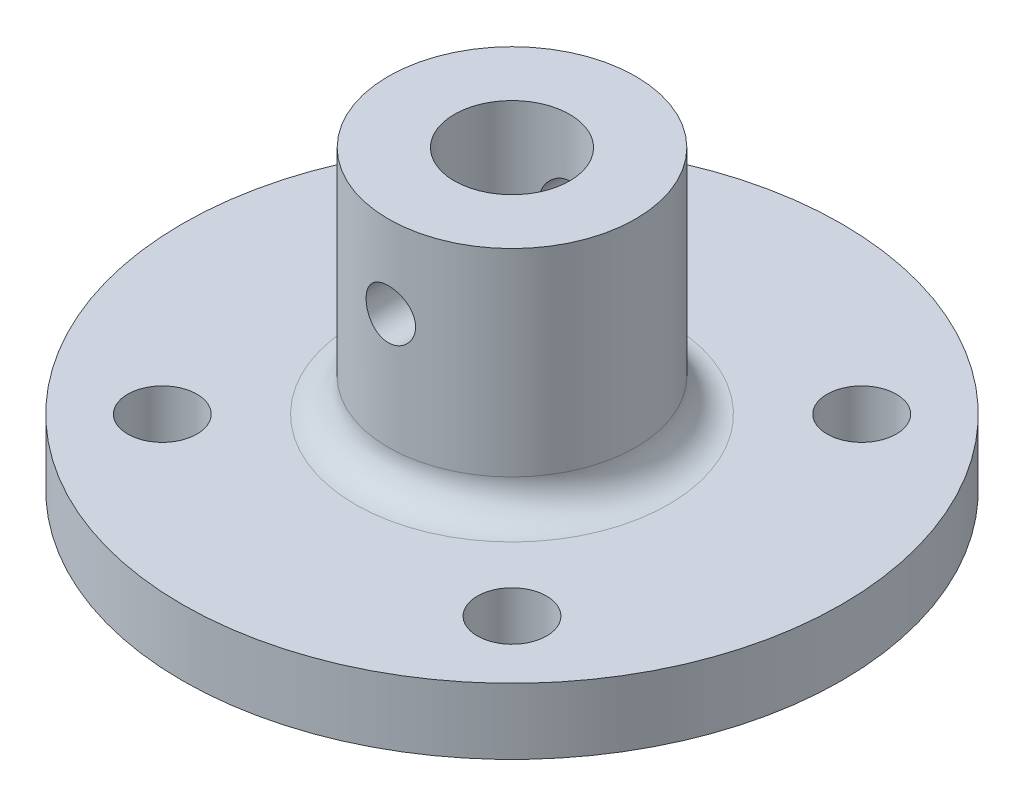
ISO-10303-21;
HEADER;
FILE_DESCRIPTION(('STEP AP214'),'2;1');
FILE_NAME('part.step','',(''),(''),'','','');
FILE_SCHEMA(('AUTOMOTIVE_DESIGN { 1 0 10303 214 1 1 1 1 }'));
ENDSEC;
DATA;
#1=APPLICATION_CONTEXT('core data for automotive mechanical design processes');
#2=APPLICATION_PROTOCOL_DEFINITION('international standard','automotive_design',2000,#1);
#3=PRODUCT_CONTEXT('',#1,'mechanical');
#4=PRODUCT('Part','Part','',(#3));
#5=PRODUCT_RELATED_PRODUCT_CATEGORY('part','',(#4));
#6=PRODUCT_DEFINITION_FORMATION('','',#4);
#7=PRODUCT_DEFINITION_CONTEXT('part definition',#1,'design');
#8=PRODUCT_DEFINITION('design','',#6,#7);
#9=PRODUCT_DEFINITION_SHAPE('','',#8);
#10=(LENGTH_UNIT() NAMED_UNIT(*) SI_UNIT(.MILLI.,.METRE.));
#11=(NAMED_UNIT(*) PLANE_ANGLE_UNIT() SI_UNIT($,.RADIAN.));
#12=(NAMED_UNIT(*) SI_UNIT($,.STERADIAN.) SOLID_ANGLE_UNIT());
#13=UNCERTAINTY_MEASURE_WITH_UNIT(LENGTH_MEASURE(1.E-05),#10,'distance_accuracy_value','');
#14=(GEOMETRIC_REPRESENTATION_CONTEXT(3) GLOBAL_UNCERTAINTY_ASSIGNED_CONTEXT((#13)) GLOBAL_UNIT_ASSIGNED_CONTEXT((#10,
#11,#12)) REPRESENTATION_CONTEXT('',''));
#15=CARTESIAN_POINT('',(0.,0.,0.));
#16=DIRECTION('',(0.,0.,1.));
#17=DIRECTION('',(1.,0.,0.));
#18=AXIS2_PLACEMENT_3D('',#15,#16,#17);
#19=CARTESIAN_POINT('',(0.,4.,0.));
#20=DIRECTION('',(0.,-1.,0.));
#21=DIRECTION('',(0.,0.,-1.));
#22=AXIS2_PLACEMENT_3D('',#19,#20,#21);
#23=CYLINDRICAL_SURFACE('',#22,20.);
#24=CARTESIAN_POINT('',(0.,4.,0.));
#25=DIRECTION('',(0.,1.,0.));
#26=DIRECTION('',(0.,0.,1.));
#27=AXIS2_PLACEMENT_3D('',#24,#25,#26);
#28=CIRCLE('',#27,20.);
#29=CARTESIAN_POINT('',(0.,4.,20.));
#30=VERTEX_POINT('',#29);
#31=EDGE_CURVE('E50',#30,#30,#28,.T.);
#32=ORIENTED_EDGE('',*,*,#31,.F.);
#33=EDGE_LOOP('',(#32));
#34=FACE_BOUND('',#33,.T.);
#35=CARTESIAN_POINT('',(0.,0.,0.));
#36=DIRECTION('',(0.,1.,0.));
#37=DIRECTION('',(0.,0.,1.));
#38=AXIS2_PLACEMENT_3D('',#35,#36,#37);
#39=CIRCLE('',#38,20.);
#40=CARTESIAN_POINT('',(0.,0.,20.));
#41=VERTEX_POINT('',#40);
#42=EDGE_CURVE('E55',#41,#41,#39,.T.);
#43=ORIENTED_EDGE('',*,*,#42,.T.);
#44=EDGE_LOOP('',(#43));
#45=FACE_BOUND('',#44,.T.);
#46=ADVANCED_FACE('F37',(#34,#45),#23,.T.);
#47=CARTESIAN_POINT('',(0.,4.,0.));
#48=DIRECTION('',(0.,1.,0.));
#49=DIRECTION('',(0.,0.,1.));
#50=AXIS2_PLACEMENT_3D('',#47,#48,#49);
#51=PLANE('',#50);
#52=CARTESIAN_POINT('',(-10.6066017177982,4.,10.6066017177982));
#53=DIRECTION('',(0.,1.,0.));
#54=DIRECTION('',(0.,0.,1.));
#55=AXIS2_PLACEMENT_3D('',#52,#53,#54);
#56=CIRCLE('',#55,2.1);
#57=CARTESIAN_POINT('',(-10.6066017177982,4.,12.7066017177982));
#58=VERTEX_POINT('',#57);
#59=EDGE_CURVE('E257',#58,#58,#56,.T.);
#60=ORIENTED_EDGE('',*,*,#59,.F.);
#61=EDGE_LOOP('',(#60));
#62=FACE_BOUND('',#61,.T.);
#63=CARTESIAN_POINT('',(-10.6066017177982,4.,-10.6066017177982));
#64=DIRECTION('',(0.,1.,0.));
#65=DIRECTION('',(0.,0.,1.));
#66=AXIS2_PLACEMENT_3D('',#63,#64,#65);
#67=CIRCLE('',#66,2.1);
#68=CARTESIAN_POINT('',(-10.6066017177982,4.,-8.50660171779819));
#69=VERTEX_POINT('',#68);
#70=EDGE_CURVE('E261',#69,#69,#67,.T.);
#71=ORIENTED_EDGE('',*,*,#70,.F.);
#72=EDGE_LOOP('',(#71));
#73=FACE_BOUND('',#72,.T.);
#74=CARTESIAN_POINT('',(10.6066017177982,4.,-10.6066017177982));
#75=DIRECTION('',(0.,1.,0.));
#76=DIRECTION('',(0.,0.,1.));
#77=AXIS2_PLACEMENT_3D('',#74,#75,#76);
#78=CIRCLE('',#77,2.1);
#79=CARTESIAN_POINT('',(10.6066017177982,4.,-8.50660171779819));
#80=VERTEX_POINT('',#79);
#81=EDGE_CURVE('E278',#80,#80,#78,.T.);
#82=ORIENTED_EDGE('',*,*,#81,.F.);
#83=EDGE_LOOP('',(#82));
#84=FACE_BOUND('',#83,.T.);
#85=CARTESIAN_POINT('',(10.6066017177982,4.,10.6066017177982));
#86=DIRECTION('',(0.,1.,0.));
#87=DIRECTION('',(0.,0.,1.));
#88=AXIS2_PLACEMENT_3D('',#85,#86,#87);
#89=CIRCLE('',#88,2.1);
#90=CARTESIAN_POINT('',(10.6066017177982,4.,12.7066017177982));
#91=VERTEX_POINT('',#90);
#92=EDGE_CURVE('E99',#91,#91,#89,.T.);
#93=ORIENTED_EDGE('',*,*,#92,.F.);
#94=EDGE_LOOP('',(#93));
#95=FACE_BOUND('',#94,.T.);
#96=CARTESIAN_POINT('',(0.,4.,0.));
#97=DIRECTION('',(0.,1.,0.));
#98=DIRECTION('',(0.,0.,1.));
#99=AXIS2_PLACEMENT_3D('',#96,#97,#98);
#100=CIRCLE('',#99,9.5);
#101=CARTESIAN_POINT('',(0.,4.,9.5));
#102=VERTEX_POINT('',#101);
#103=EDGE_CURVE('E10',#102,#102,#100,.F.);
#104=ORIENTED_EDGE('',*,*,#103,.T.);
#105=EDGE_LOOP('',(#104));
#106=FACE_BOUND('',#105,.T.);
#107=ORIENTED_EDGE('',*,*,#31,.T.);
#108=EDGE_LOOP('',(#107));
#109=FACE_BOUND('',#108,.T.);
#110=ADVANCED_FACE('F111',(#62,#73,#84,#95,#106,#109),#51,.T.);
#111=CARTESIAN_POINT('',(0.,0.,0.));
#112=DIRECTION('',(0.,1.,0.));
#113=DIRECTION('',(0.,0.,1.));
#114=AXIS2_PLACEMENT_3D('',#111,#112,#113);
#115=PLANE('',#114);
#116=CARTESIAN_POINT('',(-10.6066017177982,0.,10.6066017177982));
#117=DIRECTION('',(0.,1.,0.));
#118=DIRECTION('',(0.,0.,1.));
#119=AXIS2_PLACEMENT_3D('',#116,#117,#118);
#120=CIRCLE('',#119,2.1);
#121=CARTESIAN_POINT('',(-10.6066017177982,0.,12.7066017177982));
#122=VERTEX_POINT('',#121);
#123=EDGE_CURVE('E254',#122,#122,#120,.T.);
#124=ORIENTED_EDGE('',*,*,#123,.T.);
#125=EDGE_LOOP('',(#124));
#126=FACE_BOUND('',#125,.T.);
#127=CARTESIAN_POINT('',(-10.6066017177982,0.,-10.6066017177982));
#128=DIRECTION('',(0.,1.,0.));
#129=DIRECTION('',(0.,0.,1.));
#130=AXIS2_PLACEMENT_3D('',#127,#128,#129);
#131=CIRCLE('',#130,2.1);
#132=CARTESIAN_POINT('',(-10.6066017177982,0.,-8.50660171779819));
#133=VERTEX_POINT('',#132);
#134=EDGE_CURVE('E284',#133,#133,#131,.T.);
#135=ORIENTED_EDGE('',*,*,#134,.T.);
#136=EDGE_LOOP('',(#135));
#137=FACE_BOUND('',#136,.T.);
#138=CARTESIAN_POINT('',(10.6066017177982,0.,-10.6066017177982));
#139=DIRECTION('',(0.,1.,0.));
#140=DIRECTION('',(0.,0.,1.));
#141=AXIS2_PLACEMENT_3D('',#138,#139,#140);
#142=CIRCLE('',#141,2.1);
#143=CARTESIAN_POINT('',(10.6066017177982,0.,-8.50660171779819));
#144=VERTEX_POINT('',#143);
#145=EDGE_CURVE('E273',#144,#144,#142,.T.);
#146=ORIENTED_EDGE('',*,*,#145,.T.);
#147=EDGE_LOOP('',(#146));
#148=FACE_BOUND('',#147,.T.);
#149=CARTESIAN_POINT('',(10.6066017177982,0.,10.6066017177982));
#150=DIRECTION('',(0.,1.,0.));
#151=DIRECTION('',(0.,0.,1.));
#152=AXIS2_PLACEMENT_3D('',#149,#150,#151);
#153=CIRCLE('',#152,2.1);
#154=CARTESIAN_POINT('',(10.6066017177982,0.,12.7066017177982));
#155=VERTEX_POINT('',#154);
#156=EDGE_CURVE('E264',#155,#155,#153,.T.);
#157=ORIENTED_EDGE('',*,*,#156,.T.);
#158=EDGE_LOOP('',(#157));
#159=FACE_BOUND('',#158,.T.);
#160=ORIENTED_EDGE('',*,*,#42,.F.);
#161=EDGE_LOOP('',(#160));
#162=FACE_BOUND('',#161,.T.);
#163=ADVANCED_FACE('F110',(#126,#137,#148,#159,#162),#115,.F.);
#164=CARTESIAN_POINT('',(0.,18.,0.));
#165=DIRECTION('',(0.,-1.,0.));
#166=DIRECTION('',(0.,0.,-1.));
#167=AXIS2_PLACEMENT_3D('',#164,#165,#166);
#168=CYLINDRICAL_SURFACE('',#167,7.5);
#169=CARTESIAN_POINT('',(0.,6.,0.));
#170=DIRECTION('',(0.,1.,0.));
#171=DIRECTION('',(0.,0.,1.));
#172=AXIS2_PLACEMENT_3D('',#169,#170,#171);
#173=CIRCLE('',#172,7.5);
#174=CARTESIAN_POINT('',(0.,6.,7.5));
#175=VERTEX_POINT('',#174);
#176=EDGE_CURVE('E45',#175,#175,#173,.T.);
#177=ORIENTED_EDGE('',*,*,#176,.T.);
#178=EDGE_LOOP('',(#177));
#179=FACE_BOUND('',#178,.T.);
#180=CARTESIAN_POINT('',(0.,14.5,-7.5));
#181=CARTESIAN_POINT('',(-0.0833653601889497,14.4999969332525,-7.49999846371307));
#182=CARTESIAN_POINT('',(-0.166769490302283,14.4930267355485,-7.49859577767346));
#183=CARTESIAN_POINT('',(-0.331220261533529,14.4653522498271,-7.49313548434847));
#184=CARTESIAN_POINT('',(-0.412264976312033,14.4446370507977,-7.48907576790279));
#185=CARTESIAN_POINT('',(-0.569595457894969,14.3901380895688,-7.4787547391743));
#186=CARTESIAN_POINT('',(-0.645885701899701,14.356366844733,-7.47249553615077));
#187=CARTESIAN_POINT('',(-0.791711983296338,14.2767516287331,-7.45845597052972));
#188=CARTESIAN_POINT('',(-0.861248422613717,14.2309083765892,-7.4506756985356));
#189=CARTESIAN_POINT('',(-0.992540215972297,14.1277922585629,-7.43433247994955));
#190=CARTESIAN_POINT('',(-1.05419092673779,14.0703874669132,-7.42576118256521));
#191=CARTESIAN_POINT('',(-1.16705513491204,13.9460613754125,-7.40886270678882));
#192=CARTESIAN_POINT('',(-1.21826781715564,13.8791393329973,-7.40053554750636));
#193=CARTESIAN_POINT('',(-1.30924763002143,13.7369257104822,-7.38498662718923));
#194=CARTESIAN_POINT('',(-1.3489064082988,13.6615635343055,-7.37777561047419));
#195=CARTESIAN_POINT('',(-1.41495849987046,13.5050772714939,-7.36539402087627));
#196=CARTESIAN_POINT('',(-1.44135312365586,13.4239537549805,-7.36022324642942));
#197=CARTESIAN_POINT('',(-1.47978794982724,13.2593734541381,-7.35259207878307));
#198=CARTESIAN_POINT('',(-1.49201174693817,13.1759611837867,-7.35009705160781));
#199=CARTESIAN_POINT('',(-1.50232819158918,13.0082352679535,-7.34799562590941));
#200=CARTESIAN_POINT('',(-1.50042228407025,12.9239217155198,-7.34838893201761));
#201=CARTESIAN_POINT('',(-1.48268185965273,12.7581298179685,-7.35198826722277));
#202=CARTESIAN_POINT('',(-1.46705781036586,12.676627891559,-7.35515179288145));
#203=CARTESIAN_POINT('',(-1.42265682693458,12.5174258850055,-7.36386819240002));
#204=CARTESIAN_POINT('',(-1.39387926465102,12.4397259866215,-7.36942118036668));
#205=CARTESIAN_POINT('',(-1.32378717551208,12.2897271074446,-7.38233427750612));
#206=CARTESIAN_POINT('',(-1.28238922684817,12.2174681806462,-7.38970634720557));
#207=CARTESIAN_POINT('',(-1.18829036185902,12.0808437250408,-7.40541928159593));
#208=CARTESIAN_POINT('',(-1.13558814653524,12.0164791047233,-7.41376025757549));
#209=CARTESIAN_POINT('',(-1.01924990184088,11.8962558963146,-7.43065531862193));
#210=CARTESIAN_POINT('',(-0.955434241818668,11.8405711482113,-7.43921053816357));
#211=CARTESIAN_POINT('',(-0.819277536093015,11.7406692305482,-7.45543273071613));
#212=CARTESIAN_POINT('',(-0.746936381069084,11.6964522080596,-7.4630996923346));
#213=CARTESIAN_POINT('',(-0.595589080318382,11.620708736161,-7.47670035241331));
#214=CARTESIAN_POINT('',(-0.51657272937795,11.5892021595332,-7.48263133272408));
#215=CARTESIAN_POINT('',(-0.354223464672997,11.5399592889422,-7.49207113481787));
#216=CARTESIAN_POINT('',(-0.270891075108675,11.5222213268896,-7.49558025000797));
#217=CARTESIAN_POINT('',(-0.103769108440726,11.5012653193086,-7.49974007800302));
#218=CARTESIAN_POINT('',(-0.0200104924883651,11.4978093706896,-7.50043761978705));
#219=CARTESIAN_POINT('',(0.14688740128907,11.5048747884133,-7.49902577895154));
#220=CARTESIAN_POINT('',(0.230026713665689,11.5153953690289,-7.49691655412169));
#221=CARTESIAN_POINT('',(0.39255848991981,11.5499175603159,-7.49015748012026));
#222=CARTESIAN_POINT('',(0.471977922509854,11.5737971027469,-7.4855306460631));
#223=CARTESIAN_POINT('',(0.6256854412495,11.6342259739837,-7.47425328091549));
#224=CARTESIAN_POINT('',(0.699973142456308,11.6707762520152,-7.4676025982134));
#225=CARTESIAN_POINT('',(0.842311760529325,11.756023735977,-7.45289867299942));
#226=CARTESIAN_POINT('',(0.91027519012828,11.8048641715584,-7.44482925655578));
#227=CARTESIAN_POINT('',(1.03712702867881,11.9131137868109,-7.42822102244824));
#228=CARTESIAN_POINT('',(1.09601446339614,11.9725240995998,-7.41968215452582));
#229=CARTESIAN_POINT('',(1.20396088616126,12.1013100278367,-7.40293955335447));
#230=CARTESIAN_POINT('',(1.25285655367298,12.170823616332,-7.39474290349956));
#231=CARTESIAN_POINT('',(1.33827813007681,12.317217042035,-7.37976287694291));
#232=CARTESIAN_POINT('',(1.37480453388435,12.3940965843603,-7.37297944370014));
#233=CARTESIAN_POINT('',(1.43422776237294,12.5526523692243,-7.36165110876574));
#234=CARTESIAN_POINT('',(1.45719524968658,12.6343012618155,-7.3570946230828));
#235=CARTESIAN_POINT('',(1.48906297744079,12.8004001802364,-7.35071155188038));
#236=CARTESIAN_POINT('',(1.49796505233767,12.884849839314,-7.34888461036667));
#237=CARTESIAN_POINT('',(1.5013813663012,13.0525132968165,-7.34818724447069));
#238=CARTESIAN_POINT('',(1.49615368210634,13.1357217233905,-7.34926378783951));
#239=CARTESIAN_POINT('',(1.47202845615009,13.3000474748575,-7.35413360226921));
#240=CARTESIAN_POINT('',(1.45313102419395,13.3811648165422,-7.35792685150754));
#241=CARTESIAN_POINT('',(1.40231785274843,13.5388415668608,-7.36777896328738));
#242=CARTESIAN_POINT('',(1.37043376007602,13.6154115407536,-7.37383231528246));
#243=CARTESIAN_POINT('',(1.29458196690241,13.7621555811017,-7.38752572461255));
#244=CARTESIAN_POINT('',(1.25061325316232,13.8323291105877,-7.39516591498341));
#245=CARTESIAN_POINT('',(1.15095887217962,13.9655733582255,-7.41133440784838));
#246=CARTESIAN_POINT('',(1.09508683085277,14.0285031479014,-7.41987559364549));
#247=CARTESIAN_POINT('',(0.973596553519711,14.1441793082938,-7.43679122807932));
#248=CARTESIAN_POINT('',(0.907976080730003,14.1969233354759,-7.44516563794777));
#249=CARTESIAN_POINT('',(0.768026443632371,14.2912519659197,-7.46090748581957));
#250=CARTESIAN_POINT('',(0.693613326644754,14.33271400492,-7.46826346828869));
#251=CARTESIAN_POINT('',(0.538749541411101,14.4024791838949,-7.481026876275));
#252=CARTESIAN_POINT('',(0.458304391294691,14.4307941842987,-7.48643605707924));
#253=CARTESIAN_POINT('',(0.31473223338567,14.4679779220671,-7.49364558893056));
#254=CARTESIAN_POINT('',(0.252422496020677,14.4799647905616,-7.49601454737677));
#255=CARTESIAN_POINT('',(0.1267492878151,14.4959768685376,-7.49919231209839));
#256=CARTESIAN_POINT('',(0.0633858506229285,14.5000023317647,-7.50000116809732));
#257=CARTESIAN_POINT('',(0.,14.5,-7.5));
#258=B_SPLINE_CURVE_WITH_KNOTS('',3,(#180,#181,#182,#183,#184,#185,#186,#187,#188,#189,#190,
#191,#192,#193,#194,#195,#196,#197,#198,#199,#200,#201,#202,#203,#204,#205,#206,#207,#208,#209,
#210,#211,#212,#213,#214,#215,#216,#217,#218,#219,#220,#221,#222,#223,#224,#225,#226,#227,#228,
#229,#230,#231,#232,#233,#234,#235,#236,#237,#238,#239,#240,#241,#242,#243,#244,#245,#246,#247,
#248,#249,#250,#251,#252,#253,#254,#255,#256,#257),.UNSPECIFIED.,.T.,.F.,(4,2,2,2,2,2,2,2,2,2,2,
2,2,2,2,2,2,2,2,2,2,2,2,2,2,2,2,2,2,2,2,2,2,2,2,2,2,2,4),(0.,0.249864195991888,
0.499926976036984,0.749750602875511,0.999559353346295,1.25239900516828,1.50525839512105,
1.76041792508884,2.01555224047796,2.26734277655381,2.51910756421838,2.76707590509418,
3.01505608880594,3.26471235305389,3.51439732124506,3.76857378737026,4.0227535130973,
4.27732912281036,4.53187388547054,4.78216103514398,5.03243411486801,5.28045680926085,
5.52849808824034,5.77957599050038,6.03068082518895,6.28560942868839,6.540527830852,
6.79410571549085,7.04765052495622,7.29659583851552,7.54553915238912,7.79387941879665,
8.042240513728,8.29482114358714,8.54745981799396,8.80274245013455,9.05779433276278,
9.24778162934841,9.43776287056494),.UNSPECIFIED.);
#259=CARTESIAN_POINT('',(0.,14.5,-7.5));
#260=VERTEX_POINT('',#259);
#261=EDGE_CURVE('E98',#260,#260,#258,.T.);
#262=ORIENTED_EDGE('',*,*,#261,.T.);
#263=EDGE_LOOP('',(#262));
#264=FACE_BOUND('',#263,.T.);
#265=CARTESIAN_POINT('',(1.5,13.,7.34846922834953));
#266=CARTESIAN_POINT('',(1.49999691881235,12.9166534367642,7.34847088538349));
#267=CARTESIAN_POINT('',(1.49302975757707,12.8332680650003,7.34990262402618));
#268=CARTESIAN_POINT('',(1.46536842537441,12.668856242285,7.35546646957746));
#269=CARTESIAN_POINT('',(1.44466327060578,12.587831733046,7.35960073717297));
#270=CARTESIAN_POINT('',(1.39019367392958,12.4305440449688,7.37008310582665));
#271=CARTESIAN_POINT('',(1.35644222122892,12.3542762177011,7.37642900431582));
#272=CARTESIAN_POINT('',(1.27687366150577,12.2084877329546,7.39061699221019));
#273=CARTESIAN_POINT('',(1.23105722790173,12.1389666991931,7.398458998102));
#274=CARTESIAN_POINT('',(1.12796861348015,12.0076584942192,7.4148794954137));
#275=CARTESIAN_POINT('',(1.07055848386998,11.945980618174,7.42346606755867));
#276=CARTESIAN_POINT('',(0.946210183531966,11.8330636996315,7.440337084539));
#277=CARTESIAN_POINT('',(0.879271345466977,11.7818253888742,7.44862150816248));
#278=CARTESIAN_POINT('',(0.737042033886385,11.6908179735573,7.46404194626342));
#279=CARTESIAN_POINT('',(0.661683851508318,11.651152729275,7.47116732162326));
#280=CARTESIAN_POINT('',(0.505206225580909,11.5850875944278,7.48337605325447));
#281=CARTESIAN_POINT('',(0.424087322130832,11.5586864621485,7.48845960066179));
#282=CARTESIAN_POINT('',(0.259525159917743,11.5202392095706,7.49595481032628));
#283=CARTESIAN_POINT('',(0.176126608822223,11.5080085336435,7.4984007943219));
#284=CARTESIAN_POINT('',(0.00842785265630619,11.4976735722425,7.50046381775405));
#285=CARTESIAN_POINT('',(-0.075872264747763,11.4995679255313,7.50008112979138));
#286=CARTESIAN_POINT('',(-0.241713001115381,11.5172892703233,7.49655652302773));
#287=CARTESIAN_POINT('',(-0.323275821447704,11.5329174657518,7.49345397548757));
#288=CARTESIAN_POINT('',(-0.48259743987045,11.5773475486883,7.48488265739113));
#289=CARTESIAN_POINT('',(-0.560356085620692,11.6061499632878,7.47941379216059));
#290=CARTESIAN_POINT('',(-0.710429194801329,11.6762950602209,7.46665944029938));
#291=CARTESIAN_POINT('',(-0.782706261200849,11.7177156266573,7.45936272262835));
#292=CARTESIAN_POINT('',(-0.919357568789632,11.8118636158549,7.44375704210678));
#293=CARTESIAN_POINT('',(-0.983730899287499,11.8645923396558,7.43544796282833));
#294=CARTESIAN_POINT('',(-1.10392714658018,11.9809504331627,7.41856446546689));
#295=CARTESIAN_POINT('',(-1.15958147486045,12.0447537800944,7.40998794686274));
#296=CARTESIAN_POINT('',(-1.25942773976521,12.1808746636761,7.39367357398141));
#297=CARTESIAN_POINT('',(-1.30361945959163,12.2531923613248,7.38593573556822));
#298=CARTESIAN_POINT('',(-1.37934422220282,12.4045312477327,7.37217071209385));
#299=CARTESIAN_POINT('',(-1.41084997166656,12.4835664514595,7.36614722345324));
#300=CARTESIAN_POINT('',(-1.46008551244137,12.645956985586,7.35654714481909));
#301=CARTESIAN_POINT('',(-1.47781709918496,12.7293117514286,7.35297023592642));
#302=CARTESIAN_POINT('',(-1.49874900905408,12.8964472869986,7.34873218901742));
#303=CARTESIAN_POINT('',(-1.50219278834687,12.9801963614655,7.34802220585731));
#304=CARTESIAN_POINT('',(-1.49510644246611,13.1470723347995,7.34946728533281));
#305=CARTESIAN_POINT('',(-1.48457710968366,13.2301992686783,7.35162218550582));
#306=CARTESIAN_POINT('',(-1.45005331211124,13.3926529604384,7.35850848742372));
#307=CARTESIAN_POINT('',(-1.42618893125895,13.4720085145536,7.36321498521745));
#308=CARTESIAN_POINT('',(-1.36581155296278,13.6255949185431,7.37465234027497));
#309=CARTESIAN_POINT('',(-1.32929751355977,13.6998253456536,7.38138336429404));
#310=CARTESIAN_POINT('',(-1.2441062133234,13.8421196649252,7.39622108943059));
#311=CARTESIAN_POINT('',(-1.19527661697413,13.9100905694512,7.40434457797355));
#312=CARTESIAN_POINT('',(-1.08704335831907,14.0369624680014,7.42100585739955));
#313=CARTESIAN_POINT('',(-1.02763860771681,14.0958625273739,7.42954369085727));
#314=CARTESIAN_POINT('',(-0.898848410246836,14.2038438387784,7.44623018803823));
#315=CARTESIAN_POINT('',(-0.829323748394445,14.252760481975,7.45437086563026));
#316=CARTESIAN_POINT('',(-0.682901844952134,14.3382188222494,7.4692069144293));
#317=CARTESIAN_POINT('',(-0.606004913150261,14.3747610390172,7.47590234632816));
#318=CARTESIAN_POINT('',(-0.44745402123602,14.43419330762,7.487059410916));
#319=CARTESIAN_POINT('',(-0.365830010217118,14.4571607773394,7.49153368713906));
#320=CARTESIAN_POINT('',(-0.19978418201987,14.4890368714958,7.4977985390649));
#321=CARTESIAN_POINT('',(-0.115362703066822,14.4979471892135,7.49958943799765));
#322=CARTESIAN_POINT('',(0.0523093408554338,14.5013904714443,7.50027810681181));
#323=CARTESIAN_POINT('',(0.135554718212252,14.4961709206843,7.49922567824026));
#324=CARTESIAN_POINT('',(0.299956546973461,14.4720490741783,7.49445065340477));
#325=CARTESIAN_POINT('',(0.381113024630535,14.4531469504779,7.49072809071528));
#326=CARTESIAN_POINT('',(0.538879124617642,14.4023065118625,7.481032475475));
#327=CARTESIAN_POINT('',(0.615498664860419,14.3703979328032,7.47506455871866));
#328=CARTESIAN_POINT('',(0.762331830278927,14.2944816380037,7.46152083185077));
#329=CARTESIAN_POINT('',(0.832544948651116,14.2504729661444,7.45394489468828));
#330=CARTESIAN_POINT('',(0.965795835159534,14.1507709194069,7.43786398736791));
#331=CARTESIAN_POINT('',(1.02869957417475,14.0949004954198,7.4293460013317));
#332=CARTESIAN_POINT('',(1.14432392663527,13.9734246398564,7.41241834355477));
#333=CARTESIAN_POINT('',(1.19704212480408,13.9078169057969,7.40400869794476));
#334=CARTESIAN_POINT('',(1.29133832918279,13.7678810249497,7.3881501412478));
#335=CARTESIAN_POINT('',(1.33279022195961,13.6934665582593,7.38071255446371));
#336=CARTESIAN_POINT('',(1.40253607393175,13.5386008400506,7.36777855777287));
#337=CARTESIAN_POINT('',(1.43084196896908,13.4581551419537,7.36228038807748));
#338=CARTESIAN_POINT('',(1.4680037097813,13.3146063168448,7.3549452169166));
#339=CARTESIAN_POINT('',(1.47998084778413,13.2523218707315,7.35253177367824));
#340=CARTESIAN_POINT('',(1.49598002694097,13.1266990681709,7.34929317692711));
#341=CARTESIAN_POINT('',(1.50000234234439,13.0633607481326,7.34846796865859));
#342=CARTESIAN_POINT('',(1.5,13.,7.34846922834953));
#343=B_SPLINE_CURVE_WITH_KNOTS('',3,(#265,#266,#267,#268,#269,#270,#271,#272,#273,#274,#275,
#276,#277,#278,#279,#280,#281,#282,#283,#284,#285,#286,#287,#288,#289,#290,#291,#292,#293,#294,
#295,#296,#297,#298,#299,#300,#301,#302,#303,#304,#305,#306,#307,#308,#309,#310,#311,#312,#313,
#314,#315,#316,#317,#318,#319,#320,#321,#322,#323,#324,#325,#326,#327,#328,#329,#330,#331,#332,
#333,#334,#335,#336,#337,#338,#339,#340,#341,#342),.UNSPECIFIED.,.T.,.F.,(4,2,2,2,2,2,2,2,2,2,2,
2,2,2,2,2,2,2,2,2,2,2,2,2,2,2,2,2,2,2,2,2,2,2,2,2,2,2,4),(0.,0.249807695804142,
0.499815358926444,0.749574746910878,0.999320197289796,1.25223378822655,1.50516510053133,
1.76030100656175,2.01541302369839,2.26716373324621,2.51889018174372,2.76703184450306,
3.01518343610625,3.26489886333455,3.51464303655099,3.76874020143725,4.0228421718408,
4.27748794759165,4.53210052524037,4.7823563670689,5.03259801792632,5.28044012674978,
5.52830265531597,5.77939589661781,6.03051499305313,6.28548902600176,6.54045234945157,
6.79394720367975,7.04741152037442,7.29646526122029,7.54551587050135,7.79400025613177,
8.04250428202026,8.29501728038395,8.54759008334671,8.80288347868562,9.05794462633399,
9.24785705455344,9.43776293526322),.UNSPECIFIED.);
#344=CARTESIAN_POINT('',(1.5,13.,7.34846922834953));
#345=VERTEX_POINT('',#344);
#346=EDGE_CURVE('E67',#345,#345,#343,.T.);
#347=ORIENTED_EDGE('',*,*,#346,.T.);
#348=EDGE_LOOP('',(#347));
#349=FACE_BOUND('',#348,.T.);
#350=CARTESIAN_POINT('',(0.,18.,0.));
#351=DIRECTION('',(0.,1.,0.));
#352=DIRECTION('',(0.,0.,1.));
#353=AXIS2_PLACEMENT_3D('',#350,#351,#352);
#354=CIRCLE('',#353,7.5);
#355=CARTESIAN_POINT('',(0.,18.,7.5));
#356=VERTEX_POINT('',#355);
#357=EDGE_CURVE('E128',#356,#356,#354,.T.);
#358=ORIENTED_EDGE('',*,*,#357,.F.);
#359=EDGE_LOOP('',(#358));
#360=FACE_BOUND('',#359,.T.);
#361=ADVANCED_FACE('F105',(#179,#264,#349,#360),#168,.T.);
#362=CARTESIAN_POINT('',(0.,18.,0.));
#363=DIRECTION('',(0.,1.,0.));
#364=DIRECTION('',(0.,0.,1.));
#365=AXIS2_PLACEMENT_3D('',#362,#363,#364);
#366=PLANE('',#365);
#367=CARTESIAN_POINT('',(0.,18.,0.));
#368=DIRECTION('',(0.,1.,0.));
#369=DIRECTION('',(0.,0.,1.));
#370=AXIS2_PLACEMENT_3D('',#367,#368,#369);
#371=CIRCLE('',#370,3.5);
#372=CARTESIAN_POINT('',(0.,18.,3.5));
#373=VERTEX_POINT('',#372);
#374=EDGE_CURVE('E134',#373,#373,#371,.T.);
#375=ORIENTED_EDGE('',*,*,#374,.F.);
#376=EDGE_LOOP('',(#375));
#377=FACE_BOUND('',#376,.T.);
#378=ORIENTED_EDGE('',*,*,#357,.T.);
#379=EDGE_LOOP('',(#378));
#380=FACE_BOUND('',#379,.T.);
#381=ADVANCED_FACE('F109',(#377,#380),#366,.T.);
#382=CARTESIAN_POINT('',(0.,4.,0.));
#383=DIRECTION('',(0.,1.,0.));
#384=DIRECTION('',(0.,0.,1.));
#385=AXIS2_PLACEMENT_3D('',#382,#383,#384);
#386=CYLINDRICAL_SURFACE('',#385,3.5);
#387=CARTESIAN_POINT('',(0.,11.5,3.5));
#388=CARTESIAN_POINT('',(0.0801521976824064,11.500009221439,3.49999299268884));
#389=CARTESIAN_POINT('',(0.160419992198245,11.5064621297556,3.4972151640971));
#390=CARTESIAN_POINT('',(0.318671611361216,11.5320397072854,3.48637069204866));
#391=CARTESIAN_POINT('',(0.396649149090579,11.5511963697896,3.47829069608751));
#392=CARTESIAN_POINT('',(0.547768164746412,11.601335275199,3.45770786336707));
#393=CARTESIAN_POINT('',(0.620925386146736,11.6322765274627,3.44522036823866));
#394=CARTESIAN_POINT('',(0.760936446071885,11.7049321037505,3.41702837926819));
#395=CARTESIAN_POINT('',(0.827791985611416,11.746643509151,3.40132475720839));
#396=CARTESIAN_POINT('',(0.956920783546127,11.8419638541253,3.36733908702934));
#397=CARTESIAN_POINT('',(1.01882024425246,11.8960476380776,3.34896947381213));
#398=CARTESIAN_POINT('',(1.13299518436931,12.0135719261161,3.3120882776969));
#399=CARTESIAN_POINT('',(1.18526532055665,12.0770175900703,3.29357662187922));
#400=CARTESIAN_POINT('',(1.28142843548186,12.2155163637065,3.25741027462364));
#401=CARTESIAN_POINT('',(1.32473406006014,12.2910052296425,3.23985230076501));
#402=CARTESIAN_POINT('',(1.39786599574425,12.449054713467,3.2089808436345));
#403=CARTESIAN_POINT('',(1.42769964537364,12.5316114520801,3.19566505070703));
#404=CARTESIAN_POINT('',(1.47147459991436,12.6971503693095,3.17573899533535));
#405=CARTESIAN_POINT('',(1.48613747209695,12.7799038509274,3.16882610719817));
#406=CARTESIAN_POINT('',(1.50140303570396,12.9469629847676,3.16162424842019));
#407=CARTESIAN_POINT('',(1.50201414304565,13.0312676776499,3.16133131294301));
#408=CARTESIAN_POINT('',(1.48969999758096,13.1916499518488,3.16714786968021));
#409=CARTESIAN_POINT('',(1.47788056910827,13.2678353116063,3.17273435527608));
#410=CARTESIAN_POINT('',(1.44290386406528,13.417013792889,3.18879205821456));
#411=CARTESIAN_POINT('',(1.41974426417223,13.4900062569288,3.19926427650311));
#412=CARTESIAN_POINT('',(1.36228829534658,13.6326235757378,3.22415342810443));
#413=CARTESIAN_POINT('',(1.32775987214028,13.7021401471145,3.23865147551049));
#414=CARTESIAN_POINT('',(1.24871152436692,13.8346731620293,3.26994246945713));
#415=CARTESIAN_POINT('',(1.20418753740296,13.8976869474632,3.28673634798109));
#416=CARTESIAN_POINT('',(1.10171702696059,14.0213887518123,3.32256202266195));
#417=CARTESIAN_POINT('',(1.04292364428052,14.0813583647364,3.34165927694226));
#418=CARTESIAN_POINT('',(0.915936662025534,14.1908357953275,3.3786730287964));
#419=CARTESIAN_POINT('',(0.847740608139989,14.240340872939,3.39658921627429));
#420=CARTESIAN_POINT('',(0.701592911506316,14.3286219664036,3.4297984684468));
#421=CARTESIAN_POINT('',(0.623435574851148,14.3670895093528,3.44501227516835));
#422=CARTESIAN_POINT('',(0.460939847079479,14.4300751188073,3.47048698130307));
#423=CARTESIAN_POINT('',(0.376605107828833,14.4546013529888,3.48075078019998));
#424=CARTESIAN_POINT('',(0.210138119470684,14.4874669302295,3.49461763446686));
#425=CARTESIAN_POINT('',(0.12822898050547,14.4967693826572,3.49861624982293));
#426=CARTESIAN_POINT('',(-0.0360716505592616,14.5018147882041,3.50077708325871));
#427=CARTESIAN_POINT('',(-0.118462985950311,14.4975619262662,3.49894110265833));
#428=CARTESIAN_POINT('',(-0.276771219813305,14.4762921839726,3.48989338160075));
#429=CARTESIAN_POINT('',(-0.352799465751995,14.4599658392758,3.48297259736823));
#430=CARTESIAN_POINT('',(-0.500945568196323,14.415989552881,3.46476944004986));
#431=CARTESIAN_POINT('',(-0.573062936850432,14.3883382021391,3.45348652424256));
#432=CARTESIAN_POINT('',(-0.713888482619005,14.3215994202488,3.42719375756864));
#433=CARTESIAN_POINT('',(-0.78241987475753,14.2821818348864,3.41207852694255));
#434=CARTESIAN_POINT('',(-0.912142452825175,14.1933905277626,3.37971494195701));
#435=CARTESIAN_POINT('',(-0.973330487571131,14.1440125559906,3.36246567824312));
#436=CARTESIAN_POINT('',(-1.09148379765634,14.0323552060762,3.32607394349023));
#437=CARTESIAN_POINT('',(-1.14778308774279,13.9693838949601,3.30688677499573));
#438=CARTESIAN_POINT('',(-1.24921715724402,13.8346088506934,3.26992018844849));
#439=CARTESIAN_POINT('',(-1.29434883220193,13.762802669847,3.25214116277359));
#440=CARTESIAN_POINT('',(-1.37281937806384,13.6105930734857,3.21981484643715));
#441=CARTESIAN_POINT('',(-1.40593207473353,13.5300584953432,3.20533127997694));
#442=CARTESIAN_POINT('',(-1.45782942550893,13.363736836762,3.18206803761103));
#443=CARTESIAN_POINT('',(-1.47662682249981,13.2779545013294,3.17328328988834));
#444=CARTESIAN_POINT('',(-1.49805974083904,13.1110044133814,3.16321740581935));
#445=CARTESIAN_POINT('',(-1.50187346166243,13.0300203646202,3.16138962881681));
#446=CARTESIAN_POINT('',(-1.49641325085791,12.8686051281685,3.16397809086751));
#447=CARTESIAN_POINT('',(-1.48714162748686,12.7881738454847,3.16839322866983));
#448=CARTESIAN_POINT('',(-1.45678214099437,12.6344791461338,3.1824582711803));
#449=CARTESIAN_POINT('',(-1.43633482013379,12.5610605833527,3.19182357178317));
#450=CARTESIAN_POINT('',(-1.38485117000436,12.4186896378259,3.21449437287189));
#451=CARTESIAN_POINT('',(-1.35381183006239,12.3497385315467,3.22780099349553));
#452=CARTESIAN_POINT('',(-1.27981602227022,12.2135895630917,3.25787626150961));
#453=CARTESIAN_POINT('',(-1.23624027712768,12.1467651061798,3.27480834339631));
#454=CARTESIAN_POINT('',(-1.13924888881305,12.0210091364691,3.3097987990854));
#455=CARTESIAN_POINT('',(-1.08582952534294,11.962080622456,3.32785759700647));
#456=CARTESIAN_POINT('',(-0.965671675541752,11.8489969026856,3.36477750877144));
#457=CARTESIAN_POINT('',(-0.898214817981345,11.7955852661315,3.38358948911939));
#458=CARTESIAN_POINT('',(-0.754612613706937,11.7007850733069,3.41848089249468));
#459=CARTESIAN_POINT('',(-0.678463349382712,11.6594019682502,3.43455907522587));
#460=CARTESIAN_POINT('',(-0.520626802896573,11.5906554304293,3.46197513636854));
#461=CARTESIAN_POINT('',(-0.4390364028582,11.5630964700207,3.47337868320289));
#462=CARTESIAN_POINT('',(-0.27192565740434,11.5223652852328,3.49042295491409));
#463=CARTESIAN_POINT('',(-0.186418352711327,11.5091484903534,3.49608152963086));
#464=CARTESIAN_POINT('',(-0.0670267606132202,11.501119489046,3.49952115812385));
#465=CARTESIAN_POINT('',(-0.033523491060751,11.4999961431522,3.50000293079341));
#466=CARTESIAN_POINT('',(0.,11.5,3.5));
#467=B_SPLINE_CURVE_WITH_KNOTS('',3,(#387,#388,#389,#390,#391,#392,#393,#394,#395,#396,#397,
#398,#399,#400,#401,#402,#403,#404,#405,#406,#407,#408,#409,#410,#411,#412,#413,#414,#415,#416,
#417,#418,#419,#420,#421,#422,#423,#424,#425,#426,#427,#428,#429,#430,#431,#432,#433,#434,#435,
#436,#437,#438,#439,#440,#441,#442,#443,#444,#445,#446,#447,#448,#449,#450,#451,#452,#453,#454,
#455,#456,#457,#458,#459,#460,#461,#462,#463,#464,#465,#466),.UNSPECIFIED.,.T.,.F.,(4,2,2,2,2,2,
2,2,2,2,2,2,2,2,2,2,2,2,2,2,2,2,2,2,2,2,2,2,2,2,2,2,2,2,2,2,2,2,2,4),(0.,0.240357161374424,
0.481321951711673,0.721456131375707,0.961525304807655,1.21311371779253,1.46484131710872,
1.72984780430031,1.99470976114131,2.2462971341405,2.49773382188957,2.72855360159806,
2.95942069041216,3.19532704432402,3.43132944942384,3.68854918859162,3.94583619550723,
4.20973622296859,4.47348148178613,4.71978673747256,4.96601595851026,5.19915597113058,
5.43232499957122,5.67277527577344,5.91332836788289,6.17201425189602,6.43077196675482,
6.69417345394932,6.95734019712949,7.19934244432576,7.44130200762144,7.67066022550943,
7.90008369050323,8.14372375039557,8.38745608120077,8.65042084666959,8.91350460007056,
9.17275427816965,9.43119596989053,9.53172485598109),.UNSPECIFIED.);
#468=CARTESIAN_POINT('',(0.,11.5,3.5));
#469=VERTEX_POINT('',#468);
#470=EDGE_CURVE('E58',#469,#469,#467,.T.);
#471=ORIENTED_EDGE('',*,*,#470,.T.);
#472=EDGE_LOOP('',(#471));
#473=FACE_BOUND('',#472,.T.);
#474=CARTESIAN_POINT('',(1.5,13.,-3.16227766016838));
#475=CARTESIAN_POINT('',(1.49999038492545,12.9202310669546,-3.16228717298615));
#476=CARTESIAN_POINT('',(1.49359660659694,12.8403418583581,-3.16534018013075));
#477=CARTESIAN_POINT('',(1.46827542593982,12.6828833369264,-3.17716042981265));
#478=CARTESIAN_POINT('',(1.44931491353816,12.6053207198615,-3.18594276667924));
#479=CARTESIAN_POINT('',(1.39974825661799,12.4550840582022,-3.20802619745321));
#480=CARTESIAN_POINT('',(1.3691914561727,12.3823908146556,-3.22130811955254));
#481=CARTESIAN_POINT('',(1.29744502147729,12.2431820705644,-3.25086693275557));
#482=CARTESIAN_POINT('',(1.25625747429105,12.1766653609032,-3.26714323581242));
#483=CARTESIAN_POINT('',(1.16151711863135,12.0472750843835,-3.3020556513051));
#484=CARTESIAN_POINT('',(1.10737213961854,11.9848572691847,-3.32077467653238));
#485=CARTESIAN_POINT('',(0.989495816865006,11.8696486675996,-3.35778390832689));
#486=CARTESIAN_POINT('',(0.925760668427735,11.8168617205288,-3.37607394135677));
#487=CARTESIAN_POINT('',(0.786887444118556,11.7200404953643,-3.41118222051011));
#488=CARTESIAN_POINT('',(0.711357726755068,11.6765254048694,-3.42789293367331));
#489=CARTESIAN_POINT('',(0.553203581147165,11.6030178857841,-3.4569371087723));
#490=CARTESIAN_POINT('',(0.470582497238456,11.5730191240674,-3.46927262014747));
#491=CARTESIAN_POINT('',(0.305382130945829,11.5290674894389,-3.48758735586712));
#492=CARTESIAN_POINT('',(0.223047558846188,11.5143269675171,-3.49387724164572));
#493=CARTESIAN_POINT('',(0.0568497000057569,11.4987586496056,-3.50052462942354));
#494=CARTESIAN_POINT('',(-0.0270129128697478,11.4979248626218,-3.50088468598068));
#495=CARTESIAN_POINT('',(-0.188134207596873,11.5097951243902,-3.49581016618033));
#496=CARTESIAN_POINT('',(-0.265470719086092,11.5216318999745,-3.49074679776828));
#497=CARTESIAN_POINT('',(-0.416935858912366,11.5570120343274,-3.47591102813446));
#498=CARTESIAN_POINT('',(-0.491064249746498,11.5805562582134,-3.46613827891648));
#499=CARTESIAN_POINT('',(-0.635378985342391,11.6389532948628,-3.44263346664963));
#500=CARTESIAN_POINT('',(-0.705487647304969,11.6739736461748,-3.42884310391306));
#501=CARTESIAN_POINT('',(-0.839017665141776,11.7541586776779,-3.39863837501696));
#502=CARTESIAN_POINT('',(-0.902436606512513,11.7993270022658,-3.38222306678434));
#503=CARTESIAN_POINT('',(-1.02577392003805,11.9024047533429,-3.34696895152063));
#504=CARTESIAN_POINT('',(-1.08508648843663,11.9610094348956,-3.32804069559209));
#505=CARTESIAN_POINT('',(-1.19331308888253,12.0873514158162,-3.29078815665823));
#506=CARTESIAN_POINT('',(-1.24222263226406,12.1550926368739,-3.27246413723674));
#507=CARTESIAN_POINT('',(-1.32993971380651,12.3008899372612,-3.23783417736942));
#508=CARTESIAN_POINT('',(-1.36831384702014,12.379232072845,-3.22162619167355));
#509=CARTESIAN_POINT('',(-1.43107385954865,12.5421445042791,-3.19424697319981));
#510=CARTESIAN_POINT('',(-1.45547041320371,12.6267099916605,-3.18307189830842));
#511=CARTESIAN_POINT('',(-1.48799335058118,12.7935863977836,-3.16799275229804));
#512=CARTESIAN_POINT('',(-1.49710640039855,12.8756644902977,-3.16364898851198));
#513=CARTESIAN_POINT('',(-1.50171565988816,13.0402744875601,-3.16146494308516));
#514=CARTESIAN_POINT('',(-1.49721705457354,13.1228062075553,-3.16362218505066));
#515=CARTESIAN_POINT('',(-1.47563239208818,13.2799312868702,-3.17374071577831));
#516=CARTESIAN_POINT('',(-1.45944230541441,13.3546778701854,-3.18128847435202));
#517=CARTESIAN_POINT('',(-1.41614006363835,13.5003227381853,-3.2007978650071));
#518=CARTESIAN_POINT('',(-1.38902525529709,13.5712200832728,-3.21276056926751));
#519=CARTESIAN_POINT('',(-1.32334189052693,13.710604945145,-3.24038333624188));
#520=CARTESIAN_POINT('',(-1.28432659707742,13.7788536609093,-3.25618154123646));
#521=CARTESIAN_POINT('',(-1.19638562157086,13.9081753527573,-3.28950916992048));
#522=CARTESIAN_POINT('',(-1.14745548114547,13.9692450811052,-3.3070393706057));
#523=CARTESIAN_POINT('',(-1.03605747720159,14.0880144627796,-3.34369698282831));
#524=CARTESIAN_POINT('',(-0.972781802419173,14.1449576185858,-3.36283055507213));
#525=CARTESIAN_POINT('',(-0.83714233452468,14.2475671186635,-3.39913473749074));
#526=CARTESIAN_POINT('',(-0.764777632276177,14.2932323334939,-3.41630515097051));
#527=CARTESIAN_POINT('',(-0.612290393672596,14.3720413448053,-3.44690719585056));
#528=CARTESIAN_POINT('',(-0.532131490582582,14.4051225227759,-3.46032004460384));
#529=CARTESIAN_POINT('',(-0.366659881518582,14.4570748994456,-3.48173830246699));
#530=CARTESIAN_POINT('',(-0.281350477650411,14.4759551003755,-3.48974713693762));
#531=CARTESIAN_POINT('',(-0.114740191834883,14.4977887288074,-3.49904040627988));
#532=CARTESIAN_POINT('',(-0.0336030421543049,14.5018069056777,-3.50077418524232));
#533=CARTESIAN_POINT('',(0.128169808807149,14.4967022452109,-3.49858700907225));
#534=CARTESIAN_POINT('',(0.208805604242756,14.4875819550501,-3.49466715001972));
#535=CARTESIAN_POINT('',(0.364022405138257,14.457223231529,-3.48185611932799));
#536=CARTESIAN_POINT('',(0.438716867066027,14.4364730162902,-3.47316550610207));
#537=CARTESIAN_POINT('',(0.583524431853922,14.3839919680782,-3.45179100848821));
#538=CARTESIAN_POINT('',(0.65363668866997,14.352259114076,-3.43910638916064));
#539=CARTESIAN_POINT('',(0.79082085538958,14.277104822088,-3.41024047270082));
#540=CARTESIAN_POINT('',(0.857608099366119,14.2332161473868,-3.39392604407178));
#541=CARTESIAN_POINT('',(0.98315957617543,14.1356600352708,-3.35970811620735));
#542=CARTESIAN_POINT('',(1.0419206185,14.0819887288223,-3.341803989688));
#543=CARTESIAN_POINT('',(1.15419921481671,13.9618044913906,-3.30477972078024));
#544=CARTESIAN_POINT('',(1.20702595263291,13.8946419918799,-3.28566570654981));
#545=CARTESIAN_POINT('',(1.30078077887623,13.7518407424578,-3.24969238680823));
#546=CARTESIAN_POINT('',(1.34170194259386,13.6761970948968,-3.23283439654742));
#547=CARTESIAN_POINT('',(1.41018371094567,13.5184264300847,-3.20355631016088));
#548=CARTESIAN_POINT('',(1.43776832759536,13.4363113768649,-3.19112824877803));
#549=CARTESIAN_POINT('',(1.47837340972956,13.2680448200845,-3.17252771438391));
#550=CARTESIAN_POINT('',(1.49144272805064,13.1819078790467,-3.16633426473114));
#551=CARTESIAN_POINT('',(1.49899243118201,13.0636011550783,-3.16275406284903));
#552=CARTESIAN_POINT('',(1.50000383428566,13.0318101409096,-3.16227386666053));
#553=CARTESIAN_POINT('',(1.5,13.,-3.16227766016838));
#554=B_SPLINE_CURVE_WITH_KNOTS('',3,(#474,#475,#476,#477,#478,#479,#480,#481,#482,#483,#484,
#485,#486,#487,#488,#489,#490,#491,#492,#493,#494,#495,#496,#497,#498,#499,#500,#501,#502,#503,
#504,#505,#506,#507,#508,#509,#510,#511,#512,#513,#514,#515,#516,#517,#518,#519,#520,#521,#522,
#523,#524,#525,#526,#527,#528,#529,#530,#531,#532,#533,#534,#535,#536,#537,#538,#539,#540,#541,
#542,#543,#544,#545,#546,#547,#548,#549,#550,#551,#552,#553),.UNSPECIFIED.,.T.,.F.,(4,2,2,2,2,2,
2,2,2,2,2,2,2,2,2,2,2,2,2,2,2,2,2,2,2,2,2,2,2,2,2,2,2,2,2,2,2,2,2,4),(0.,0.239211516998636,
0.479055812925295,0.71789077265192,0.956678879115817,1.20974703533054,1.46291585698785,
1.72782087173741,1.992601634844,2.24290515697656,2.49310084605822,2.72720452587285,
2.96132550725882,3.19902917219044,3.43681833943188,3.69219429883402,3.94768022455396,
4.21248245374587,4.47708218938959,4.723829875421,4.97048358104407,5.20000580849601,
5.42958381263239,5.66914358774548,5.9088113247203,6.16934837221378,6.42991150089539,
6.69175474679387,6.95343186577332,7.19595274449671,7.43842661162275,7.67141114258535,
7.90443857025996,8.14809791325949,8.39185383353303,8.65331392763672,8.91492579368383,
9.17606486564864,9.43632235654432,9.53171478279883),.UNSPECIFIED.);
#555=CARTESIAN_POINT('',(1.5,13.,-3.16227766016838));
#556=VERTEX_POINT('',#555);
#557=EDGE_CURVE('E68',#556,#556,#554,.T.);
#558=ORIENTED_EDGE('',*,*,#557,.T.);
#559=EDGE_LOOP('',(#558));
#560=FACE_BOUND('',#559,.T.);
#561=CARTESIAN_POINT('',(0.,4.,0.));
#562=DIRECTION('',(0.,1.,0.));
#563=DIRECTION('',(0.,0.,1.));
#564=AXIS2_PLACEMENT_3D('',#561,#562,#563);
#565=CIRCLE('',#564,3.5);
#566=CARTESIAN_POINT('',(0.,4.,3.5));
#567=VERTEX_POINT('',#566);
#568=EDGE_CURVE('E131',#567,#567,#565,.T.);
#569=ORIENTED_EDGE('',*,*,#568,.F.);
#570=EDGE_LOOP('',(#569));
#571=FACE_BOUND('',#570,.T.);
#572=ORIENTED_EDGE('',*,*,#374,.T.);
#573=EDGE_LOOP('',(#572));
#574=FACE_BOUND('',#573,.T.);
#575=ADVANCED_FACE('F73',(#473,#560,#571,#574),#386,.F.);
#576=CARTESIAN_POINT('',(0.,4.,0.));
#577=DIRECTION('',(0.,1.,0.));
#578=DIRECTION('',(0.,0.,1.));
#579=AXIS2_PLACEMENT_3D('',#576,#577,#578);
#580=PLANE('',#579);
#581=ORIENTED_EDGE('',*,*,#568,.T.);
#582=EDGE_LOOP('',(#581));
#583=FACE_BOUND('',#582,.T.);
#584=ADVANCED_FACE('F82',(#583),#580,.T.);
#585=CARTESIAN_POINT('',(0.,13.,-20.));
#586=DIRECTION('',(0.,0.,1.));
#587=DIRECTION('',(1.,0.,0.));
#588=AXIS2_PLACEMENT_3D('',#585,#586,#587);
#589=CYLINDRICAL_SURFACE('',#588,1.5);
#590=ORIENTED_EDGE('',*,*,#557,.F.);
#591=EDGE_LOOP('',(#590));
#592=FACE_BOUND('',#591,.T.);
#593=ORIENTED_EDGE('',*,*,#261,.F.);
#594=EDGE_LOOP('',(#593));
#595=FACE_BOUND('',#594,.T.);
#596=ADVANCED_FACE('F77',(#592,#595),#589,.F.);
#597=ORIENTED_EDGE('',*,*,#470,.F.);
#598=EDGE_LOOP('',(#597));
#599=FACE_BOUND('',#598,.T.);
#600=ORIENTED_EDGE('',*,*,#346,.F.);
#601=EDGE_LOOP('',(#600));
#602=FACE_BOUND('',#601,.T.);
#603=ADVANCED_FACE('F81',(#599,#602),#589,.F.);
#604=CARTESIAN_POINT('',(0.,6.,0.));
#605=DIRECTION('',(0.,1.,0.));
#606=DIRECTION('',(0.,0.,1.));
#607=AXIS2_PLACEMENT_3D('',#604,#605,#606);
#608=TOROIDAL_SURFACE('',#607,9.5,2.);
#609=ORIENTED_EDGE('',*,*,#103,.F.);
#610=EDGE_LOOP('',(#609));
#611=FACE_BOUND('',#610,.T.);
#612=ORIENTED_EDGE('',*,*,#176,.F.);
#613=EDGE_LOOP('',(#612));
#614=FACE_BOUND('',#613,.T.);
#615=ADVANCED_FACE('F39',(#611,#614),#608,.F.);
#616=CARTESIAN_POINT('',(10.6066017177982,0.,10.6066017177982));
#617=DIRECTION('',(0.,1.,0.));
#618=DIRECTION('',(0.,0.,1.));
#619=AXIS2_PLACEMENT_3D('',#616,#617,#618);
#620=CYLINDRICAL_SURFACE('',#619,2.1);
#621=ORIENTED_EDGE('',*,*,#156,.F.);
#622=EDGE_LOOP('',(#621));
#623=FACE_BOUND('',#622,.T.);
#624=ORIENTED_EDGE('',*,*,#92,.T.);
#625=EDGE_LOOP('',(#624));
#626=FACE_BOUND('',#625,.T.);
#627=ADVANCED_FACE('F84',(#623,#626),#620,.F.);
#628=CARTESIAN_POINT('',(10.6066017177982,0.,-10.6066017177982));
#629=DIRECTION('',(0.,1.,0.));
#630=DIRECTION('',(0.,0.,1.));
#631=AXIS2_PLACEMENT_3D('',#628,#629,#630);
#632=CYLINDRICAL_SURFACE('',#631,2.1);
#633=ORIENTED_EDGE('',*,*,#145,.F.);
#634=EDGE_LOOP('',(#633));
#635=FACE_BOUND('',#634,.T.);
#636=ORIENTED_EDGE('',*,*,#81,.T.);
#637=EDGE_LOOP('',(#636));
#638=FACE_BOUND('',#637,.T.);
#639=ADVANCED_FACE('F187',(#635,#638),#632,.F.);
#640=CARTESIAN_POINT('',(-10.6066017177982,0.,-10.6066017177982));
#641=DIRECTION('',(0.,1.,0.));
#642=DIRECTION('',(0.,0.,1.));
#643=AXIS2_PLACEMENT_3D('',#640,#641,#642);
#644=CYLINDRICAL_SURFACE('',#643,2.1);
#645=ORIENTED_EDGE('',*,*,#134,.F.);
#646=EDGE_LOOP('',(#645));
#647=FACE_BOUND('',#646,.T.);
#648=ORIENTED_EDGE('',*,*,#70,.T.);
#649=EDGE_LOOP('',(#648));
#650=FACE_BOUND('',#649,.T.);
#651=ADVANCED_FACE('F195',(#647,#650),#644,.F.);
#652=CARTESIAN_POINT('',(-10.6066017177982,0.,10.6066017177982));
#653=DIRECTION('',(0.,1.,0.));
#654=DIRECTION('',(0.,0.,1.));
#655=AXIS2_PLACEMENT_3D('',#652,#653,#654);
#656=CYLINDRICAL_SURFACE('',#655,2.1);
#657=ORIENTED_EDGE('',*,*,#123,.F.);
#658=EDGE_LOOP('',(#657));
#659=FACE_BOUND('',#658,.T.);
#660=ORIENTED_EDGE('',*,*,#59,.T.);
#661=EDGE_LOOP('',(#660));
#662=FACE_BOUND('',#661,.T.);
#663=ADVANCED_FACE('F203',(#659,#662),#656,.F.);
#664=CLOSED_SHELL('',(#46,#110,#163,#361,#381,#575,#584,#596,#603,#615,#627,#639,#651,#663));
#665=MANIFOLD_SOLID_BREP('B2',#664);
#666=ADVANCED_BREP_SHAPE_REPRESENTATION('',(#18,#665),#14);
#667=SHAPE_DEFINITION_REPRESENTATION(#9,#666);
ENDSEC;
END-ISO-10303-21;
